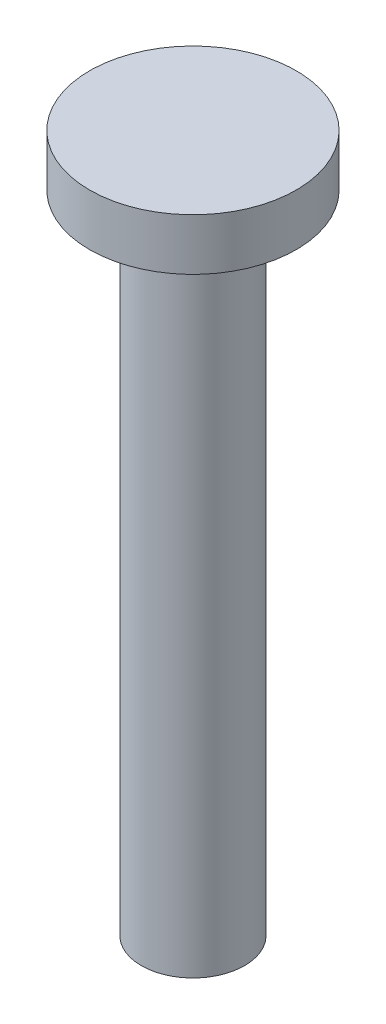
ISO-10303-21;
HEADER;
FILE_DESCRIPTION(('STEP AP214'),'2;1');
FILE_NAME('part.step','',(''),(''),'','','');
FILE_SCHEMA(('AUTOMOTIVE_DESIGN { 1 0 10303 214 1 1 1 1 }'));
ENDSEC;
DATA;
#1=APPLICATION_CONTEXT('core data for automotive mechanical design processes');
#2=APPLICATION_PROTOCOL_DEFINITION('international standard','automotive_design',2000,#1);
#3=PRODUCT_CONTEXT('',#1,'mechanical');
#4=PRODUCT('Part','Part','',(#3));
#5=PRODUCT_RELATED_PRODUCT_CATEGORY('part','',(#4));
#6=PRODUCT_DEFINITION_FORMATION('','',#4);
#7=PRODUCT_DEFINITION_CONTEXT('part definition',#1,'design');
#8=PRODUCT_DEFINITION('design','',#6,#7);
#9=PRODUCT_DEFINITION_SHAPE('','',#8);
#10=(LENGTH_UNIT() NAMED_UNIT(*) SI_UNIT(.MILLI.,.METRE.));
#11=(NAMED_UNIT(*) PLANE_ANGLE_UNIT() SI_UNIT($,.RADIAN.));
#12=(NAMED_UNIT(*) SI_UNIT($,.STERADIAN.) SOLID_ANGLE_UNIT());
#13=UNCERTAINTY_MEASURE_WITH_UNIT(LENGTH_MEASURE(1.E-05),#10,'distance_accuracy_value','');
#14=(GEOMETRIC_REPRESENTATION_CONTEXT(3) GLOBAL_UNCERTAINTY_ASSIGNED_CONTEXT((#13)) GLOBAL_UNIT_ASSIGNED_CONTEXT((#10,
#11,#12)) REPRESENTATION_CONTEXT('',''));
#15=CARTESIAN_POINT('',(0.,0.,0.));
#16=DIRECTION('',(0.,0.,1.));
#17=DIRECTION('',(1.,0.,0.));
#18=AXIS2_PLACEMENT_3D('',#15,#16,#17);
#19=CARTESIAN_POINT('',(0.,12.5,0.));
#20=DIRECTION('',(0.,-1.,0.));
#21=DIRECTION('',(0.,0.,-1.));
#22=AXIS2_PLACEMENT_3D('',#19,#20,#21);
#23=CYLINDRICAL_SURFACE('',#22,1.);
#24=CARTESIAN_POINT('',(0.,12.5,0.));
#25=DIRECTION('',(0.,1.,0.));
#26=DIRECTION('',(0.,0.,1.));
#27=AXIS2_PLACEMENT_3D('',#24,#25,#26);
#28=CIRCLE('',#27,1.);
#29=CARTESIAN_POINT('',(0.,12.5,1.));
#30=VERTEX_POINT('',#29);
#31=EDGE_CURVE('E10',#30,#30,#28,.T.);
#32=ORIENTED_EDGE('',*,*,#31,.F.);
#33=EDGE_LOOP('',(#32));
#34=FACE_BOUND('',#33,.T.);
#35=CARTESIAN_POINT('',(0.,0.,0.));
#36=DIRECTION('',(0.,1.,0.));
#37=DIRECTION('',(0.,0.,1.));
#38=AXIS2_PLACEMENT_3D('',#35,#36,#37);
#39=CIRCLE('',#38,1.);
#40=CARTESIAN_POINT('',(0.,0.,1.));
#41=VERTEX_POINT('',#40);
#42=EDGE_CURVE('E44',#41,#41,#39,.T.);
#43=ORIENTED_EDGE('',*,*,#42,.T.);
#44=EDGE_LOOP('',(#43));
#45=FACE_BOUND('',#44,.T.);
#46=ADVANCED_FACE('F41',(#34,#45),#23,.T.);
#47=CARTESIAN_POINT('',(0.,0.,0.));
#48=DIRECTION('',(0.,1.,0.));
#49=DIRECTION('',(0.,0.,1.));
#50=AXIS2_PLACEMENT_3D('',#47,#48,#49);
#51=PLANE('',#50);
#52=ORIENTED_EDGE('',*,*,#42,.F.);
#53=EDGE_LOOP('',(#52));
#54=FACE_BOUND('',#53,.T.);
#55=ADVANCED_FACE('F68',(#54),#51,.F.);
#56=CARTESIAN_POINT('',(0.,13.5,0.));
#57=DIRECTION('',(0.,-1.,0.));
#58=DIRECTION('',(0.,0.,-1.));
#59=AXIS2_PLACEMENT_3D('',#56,#57,#58);
#60=CYLINDRICAL_SURFACE('',#59,2.);
#61=CARTESIAN_POINT('',(0.,13.5,0.));
#62=DIRECTION('',(0.,1.,0.));
#63=DIRECTION('',(0.,0.,1.));
#64=AXIS2_PLACEMENT_3D('',#61,#62,#63);
#65=CIRCLE('',#64,2.);
#66=CARTESIAN_POINT('',(0.,13.5,2.));
#67=VERTEX_POINT('',#66);
#68=EDGE_CURVE('E53',#67,#67,#65,.T.);
#69=ORIENTED_EDGE('',*,*,#68,.F.);
#70=EDGE_LOOP('',(#69));
#71=FACE_BOUND('',#70,.T.);
#72=CARTESIAN_POINT('',(0.,12.5,0.));
#73=DIRECTION('',(0.,1.,0.));
#74=DIRECTION('',(0.,0.,1.));
#75=AXIS2_PLACEMENT_3D('',#72,#73,#74);
#76=CIRCLE('',#75,2.);
#77=CARTESIAN_POINT('',(0.,12.5,2.));
#78=VERTEX_POINT('',#77);
#79=EDGE_CURVE('E55',#78,#78,#76,.T.);
#80=ORIENTED_EDGE('',*,*,#79,.T.);
#81=EDGE_LOOP('',(#80));
#82=FACE_BOUND('',#81,.T.);
#83=ADVANCED_FACE('F65',(#71,#82),#60,.T.);
#84=CARTESIAN_POINT('',(0.,13.5,0.));
#85=DIRECTION('',(0.,1.,0.));
#86=DIRECTION('',(0.,0.,1.));
#87=AXIS2_PLACEMENT_3D('',#84,#85,#86);
#88=PLANE('',#87);
#89=ORIENTED_EDGE('',*,*,#68,.T.);
#90=EDGE_LOOP('',(#89));
#91=FACE_BOUND('',#90,.T.);
#92=ADVANCED_FACE('F63',(#91),#88,.T.);
#93=CARTESIAN_POINT('',(0.,12.5,0.));
#94=DIRECTION('',(0.,1.,0.));
#95=DIRECTION('',(0.,0.,1.));
#96=AXIS2_PLACEMENT_3D('',#93,#94,#95);
#97=PLANE('',#96);
#98=ORIENTED_EDGE('',*,*,#31,.T.);
#99=EDGE_LOOP('',(#98));
#100=FACE_BOUND('',#99,.T.);
#101=ORIENTED_EDGE('',*,*,#79,.F.);
#102=EDGE_LOOP('',(#101));
#103=FACE_BOUND('',#102,.T.);
#104=ADVANCED_FACE('F72',(#100,#103),#97,.F.);
#105=CLOSED_SHELL('',(#46,#55,#83,#92,#104));
#106=MANIFOLD_SOLID_BREP('B2',#105);
#107=ADVANCED_BREP_SHAPE_REPRESENTATION('',(#18,#106),#14);
#108=SHAPE_DEFINITION_REPRESENTATION(#9,#107);
ENDSEC;
END-ISO-10303-21;
